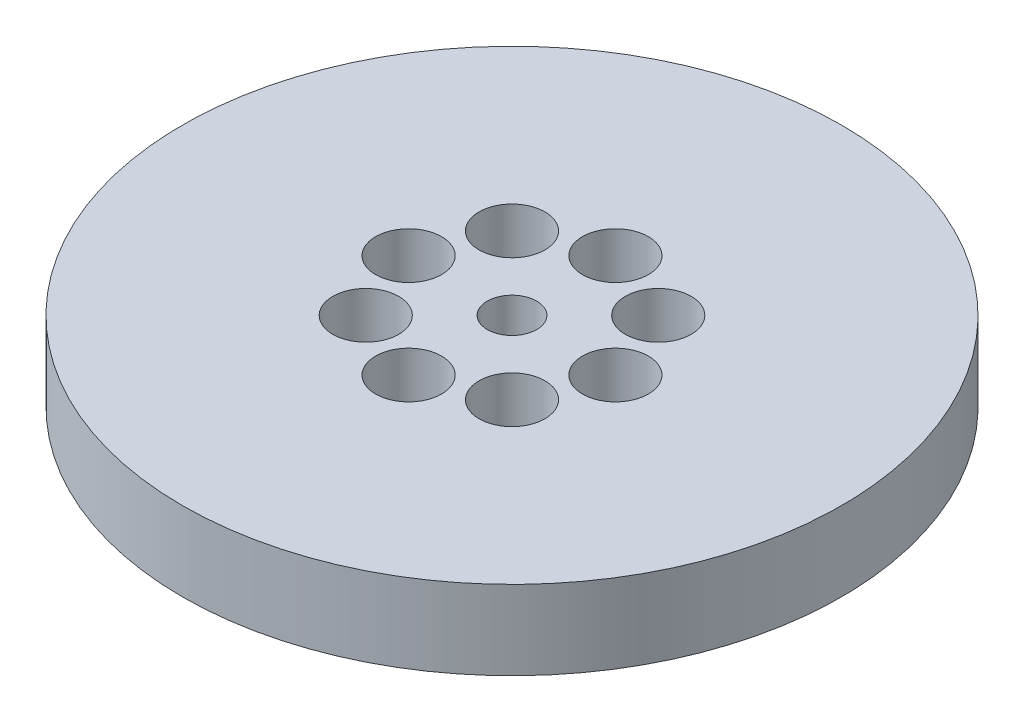
ISO-10303-21;
HEADER;
FILE_DESCRIPTION(('STEP AP214'),'2;1');
FILE_NAME('part.step','',(''),(''),'','','');
FILE_SCHEMA(('AUTOMOTIVE_DESIGN { 1 0 10303 214 1 1 1 1 }'));
ENDSEC;
DATA;
#1=APPLICATION_CONTEXT('core data for automotive mechanical design processes');
#2=APPLICATION_PROTOCOL_DEFINITION('international standard','automotive_design',2000,#1);
#3=PRODUCT_CONTEXT('',#1,'mechanical');
#4=PRODUCT('Part','Part','',(#3));
#5=PRODUCT_RELATED_PRODUCT_CATEGORY('part','',(#4));
#6=PRODUCT_DEFINITION_FORMATION('','',#4);
#7=PRODUCT_DEFINITION_CONTEXT('part definition',#1,'design');
#8=PRODUCT_DEFINITION('design','',#6,#7);
#9=PRODUCT_DEFINITION_SHAPE('','',#8);
#10=(LENGTH_UNIT() NAMED_UNIT(*) SI_UNIT(.MILLI.,.METRE.));
#11=(NAMED_UNIT(*) PLANE_ANGLE_UNIT() SI_UNIT($,.RADIAN.));
#12=(NAMED_UNIT(*) SI_UNIT($,.STERADIAN.) SOLID_ANGLE_UNIT());
#13=UNCERTAINTY_MEASURE_WITH_UNIT(LENGTH_MEASURE(1.E-05),#10,'distance_accuracy_value','');
#14=(GEOMETRIC_REPRESENTATION_CONTEXT(3) GLOBAL_UNCERTAINTY_ASSIGNED_CONTEXT((#13)) GLOBAL_UNIT_ASSIGNED_CONTEXT((#10,
#11,#12)) REPRESENTATION_CONTEXT('',''));
#15=CARTESIAN_POINT('',(0.,0.,0.));
#16=DIRECTION('',(0.,0.,1.));
#17=DIRECTION('',(1.,0.,0.));
#18=AXIS2_PLACEMENT_3D('',#15,#16,#17);
#19=CARTESIAN_POINT('',(0.,24.,0.));
#20=DIRECTION('',(0.,-1.,0.));
#21=DIRECTION('',(0.,0.,-1.));
#22=AXIS2_PLACEMENT_3D('',#19,#20,#21);
#23=CYLINDRICAL_SURFACE('',#22,100.);
#24=CARTESIAN_POINT('',(0.,24.,0.));
#25=DIRECTION('',(0.,1.,0.));
#26=DIRECTION('',(0.,0.,1.));
#27=AXIS2_PLACEMENT_3D('',#24,#25,#26);
#28=CIRCLE('',#27,100.);
#29=CARTESIAN_POINT('',(0.,24.,100.));
#30=VERTEX_POINT('',#29);
#31=EDGE_CURVE('E10',#30,#30,#28,.T.);
#32=ORIENTED_EDGE('',*,*,#31,.F.);
#33=EDGE_LOOP('',(#32));
#34=FACE_BOUND('',#33,.T.);
#35=CARTESIAN_POINT('',(0.,0.,0.));
#36=DIRECTION('',(0.,1.,0.));
#37=DIRECTION('',(0.,0.,1.));
#38=AXIS2_PLACEMENT_3D('',#35,#36,#37);
#39=CIRCLE('',#38,100.);
#40=CARTESIAN_POINT('',(0.,0.,100.));
#41=VERTEX_POINT('',#40);
#42=EDGE_CURVE('E37',#41,#41,#39,.T.);
#43=ORIENTED_EDGE('',*,*,#42,.T.);
#44=EDGE_LOOP('',(#43));
#45=FACE_BOUND('',#44,.T.);
#46=ADVANCED_FACE('F40',(#34,#45),#23,.T.);
#47=CARTESIAN_POINT('',(0.,24.,0.));
#48=DIRECTION('',(0.,1.,0.));
#49=DIRECTION('',(0.,0.,1.));
#50=AXIS2_PLACEMENT_3D('',#47,#48,#49);
#51=PLANE('',#50);
#52=CARTESIAN_POINT('',(1.09555565675562E-13,24.,31.3779611125926));
#53=DIRECTION('',(0.,1.,0.));
#54=DIRECTION('',(1.,0.,0.));
#55=AXIS2_PLACEMENT_3D('',#52,#53,#54);
#56=CIRCLE('',#55,10.);
#57=CARTESIAN_POINT('',(10.0000000000001,24.,31.3779611125925));
#58=VERTEX_POINT('',#57);
#59=EDGE_CURVE('E88',#58,#58,#56,.T.);
#60=ORIENTED_EDGE('',*,*,#59,.F.);
#61=EDGE_LOOP('',(#60));
#62=FACE_BOUND('',#61,.T.);
#63=CARTESIAN_POINT('',(22.1875690825221,24.,22.1875690825219));
#64=DIRECTION('',(0.,1.,0.));
#65=DIRECTION('',(0.707106781186544,0.,-0.707106781186551));
#66=AXIS2_PLACEMENT_3D('',#63,#64,#65);
#67=CIRCLE('',#66,10.);
#68=CARTESIAN_POINT('',(29.2586368943875,24.,15.1165012706564));
#69=VERTEX_POINT('',#68);
#70=EDGE_CURVE('E79',#69,#69,#67,.T.);
#71=ORIENTED_EDGE('',*,*,#70,.F.);
#72=EDGE_LOOP('',(#71));
#73=FACE_BOUND('',#72,.T.);
#74=CARTESIAN_POINT('',(31.3779611125926,24.,0.));
#75=DIRECTION('',(0.,1.,0.));
#76=DIRECTION('',(0.,0.,-1.));
#77=AXIS2_PLACEMENT_3D('',#74,#75,#76);
#78=CIRCLE('',#77,10.);
#79=CARTESIAN_POINT('',(31.3779611125926,24.,-10.));
#80=VERTEX_POINT('',#79);
#81=EDGE_CURVE('E74',#80,#80,#78,.T.);
#82=ORIENTED_EDGE('',*,*,#81,.F.);
#83=EDGE_LOOP('',(#82));
#84=FACE_BOUND('',#83,.T.);
#85=CARTESIAN_POINT('',(22.1875690825218,24.,-22.1875690825222));
#86=DIRECTION('',(0.,1.,0.));
#87=DIRECTION('',(-0.707106781186554,0.,-0.707106781186541));
#88=AXIS2_PLACEMENT_3D('',#85,#86,#87);
#89=CIRCLE('',#88,10.);
#90=CARTESIAN_POINT('',(15.1165012706563,24.,-29.2586368943876));
#91=VERTEX_POINT('',#90);
#92=EDGE_CURVE('E70',#91,#91,#89,.T.);
#93=ORIENTED_EDGE('',*,*,#92,.F.);
#94=EDGE_LOOP('',(#93));
#95=FACE_BOUND('',#94,.T.);
#96=CARTESIAN_POINT('',(-3.28666697026687E-13,24.,-31.3779611125926));
#97=DIRECTION('',(0.,1.,0.));
#98=DIRECTION('',(-1.,0.,0.));
#99=AXIS2_PLACEMENT_3D('',#96,#97,#98);
#100=CIRCLE('',#99,10.);
#101=CARTESIAN_POINT('',(-10.0000000000003,24.,-31.3779611125925));
#102=VERTEX_POINT('',#101);
#103=EDGE_CURVE('E100',#102,#102,#100,.T.);
#104=ORIENTED_EDGE('',*,*,#103,.F.);
#105=EDGE_LOOP('',(#104));
#106=FACE_BOUND('',#105,.T.);
#107=CARTESIAN_POINT('',(-22.1875690825222,24.,-22.1875690825217));
#108=DIRECTION('',(0.,1.,0.));
#109=DIRECTION('',(-0.707106781186539,0.,0.707106781186556));
#110=AXIS2_PLACEMENT_3D('',#107,#108,#109);
#111=CIRCLE('',#110,10.);
#112=CARTESIAN_POINT('',(-29.2586368943876,24.,-15.1165012706562));
#113=VERTEX_POINT('',#112);
#114=EDGE_CURVE('E93',#113,#113,#111,.T.);
#115=ORIENTED_EDGE('',*,*,#114,.F.);
#116=EDGE_LOOP('',(#115));
#117=FACE_BOUND('',#116,.T.);
#118=CARTESIAN_POINT('',(-22.1875690825219,24.,22.187569082522));
#119=DIRECTION('',(0.,1.,0.));
#120=DIRECTION('',(0.707106781186549,0.,0.707106781186546));
#121=AXIS2_PLACEMENT_3D('',#118,#119,#120);
#122=CIRCLE('',#121,10.);
#123=CARTESIAN_POINT('',(-15.1165012706565,24.,29.2586368943875));
#124=VERTEX_POINT('',#123);
#125=EDGE_CURVE('E61',#124,#124,#122,.T.);
#126=ORIENTED_EDGE('',*,*,#125,.F.);
#127=EDGE_LOOP('',(#126));
#128=FACE_BOUND('',#127,.T.);
#129=CARTESIAN_POINT('',(-31.3779611125926,24.,0.));
#130=DIRECTION('',(0.,1.,0.));
#131=DIRECTION('',(0.,0.,1.));
#132=AXIS2_PLACEMENT_3D('',#129,#130,#131);
#133=CIRCLE('',#132,10.);
#134=CARTESIAN_POINT('',(-31.3779611125926,24.,10.));
#135=VERTEX_POINT('',#134);
#136=EDGE_CURVE('E54',#135,#135,#133,.T.);
#137=ORIENTED_EDGE('',*,*,#136,.F.);
#138=EDGE_LOOP('',(#137));
#139=FACE_BOUND('',#138,.T.);
#140=CARTESIAN_POINT('',(0.,24.,0.));
#141=DIRECTION('',(0.,1.,0.));
#142=DIRECTION('',(0.,0.,1.));
#143=AXIS2_PLACEMENT_3D('',#140,#141,#142);
#144=CIRCLE('',#143,7.5);
#145=CARTESIAN_POINT('',(0.,24.,7.5));
#146=VERTEX_POINT('',#145);
#147=EDGE_CURVE('E50',#146,#146,#144,.T.);
#148=ORIENTED_EDGE('',*,*,#147,.F.);
#149=EDGE_LOOP('',(#148));
#150=FACE_BOUND('',#149,.T.);
#151=ORIENTED_EDGE('',*,*,#31,.T.);
#152=EDGE_LOOP('',(#151));
#153=FACE_BOUND('',#152,.T.);
#154=ADVANCED_FACE('F115',(#62,#73,#84,#95,#106,#117,#128,#139,#150,#153),#51,.T.);
#155=CARTESIAN_POINT('',(0.,0.,0.));
#156=DIRECTION('',(0.,1.,0.));
#157=DIRECTION('',(0.,0.,1.));
#158=AXIS2_PLACEMENT_3D('',#155,#156,#157);
#159=PLANE('',#158);
#160=CARTESIAN_POINT('',(0.,0.,0.));
#161=DIRECTION('',(0.,1.,0.));
#162=DIRECTION('',(0.,0.,1.));
#163=AXIS2_PLACEMENT_3D('',#160,#161,#162);
#164=CIRCLE('',#163,7.5);
#165=CARTESIAN_POINT('',(0.,0.,7.5));
#166=VERTEX_POINT('',#165);
#167=EDGE_CURVE('E47',#166,#166,#164,.T.);
#168=ORIENTED_EDGE('',*,*,#167,.T.);
#169=EDGE_LOOP('',(#168));
#170=FACE_BOUND('',#169,.T.);
#171=ORIENTED_EDGE('',*,*,#42,.F.);
#172=EDGE_LOOP('',(#171));
#173=FACE_BOUND('',#172,.T.);
#174=ADVANCED_FACE('F113',(#170,#173),#159,.F.);
#175=CARTESIAN_POINT('',(0.,24.,0.));
#176=DIRECTION('',(0.,-1.,0.));
#177=DIRECTION('',(0.,0.,-1.));
#178=AXIS2_PLACEMENT_3D('',#175,#176,#177);
#179=CYLINDRICAL_SURFACE('',#178,7.5);
#180=ORIENTED_EDGE('',*,*,#147,.T.);
#181=EDGE_LOOP('',(#180));
#182=FACE_BOUND('',#181,.T.);
#183=ORIENTED_EDGE('',*,*,#167,.F.);
#184=EDGE_LOOP('',(#183));
#185=FACE_BOUND('',#184,.T.);
#186=ADVANCED_FACE('F127',(#182,#185),#179,.F.);
#187=CARTESIAN_POINT('',(-31.3779611125926,3.09669997128235,0.));
#188=DIRECTION('',(0.,1.,0.));
#189=DIRECTION('',(0.,0.,1.));
#190=AXIS2_PLACEMENT_3D('',#187,#188,#189);
#191=CYLINDRICAL_SURFACE('',#190,10.);
#192=CARTESIAN_POINT('',(-31.3779611125926,3.09669997128235,0.));
#193=DIRECTION('',(0.,1.,0.));
#194=DIRECTION('',(0.,0.,1.));
#195=AXIS2_PLACEMENT_3D('',#192,#193,#194);
#196=CIRCLE('',#195,10.);
#197=CARTESIAN_POINT('',(-31.3779611125926,3.09669997128235,10.));
#198=VERTEX_POINT('',#197);
#199=EDGE_CURVE('E55',#198,#198,#196,.T.);
#200=ORIENTED_EDGE('',*,*,#199,.F.);
#201=EDGE_LOOP('',(#200));
#202=FACE_BOUND('',#201,.T.);
#203=ORIENTED_EDGE('',*,*,#136,.T.);
#204=EDGE_LOOP('',(#203));
#205=FACE_BOUND('',#204,.T.);
#206=ADVANCED_FACE('F129',(#202,#205),#191,.F.);
#207=CARTESIAN_POINT('',(-31.3779611125926,3.09669997128235,0.));
#208=DIRECTION('',(0.,1.,0.));
#209=DIRECTION('',(0.,0.,1.));
#210=AXIS2_PLACEMENT_3D('',#207,#208,#209);
#211=PLANE('',#210);
#212=ORIENTED_EDGE('',*,*,#199,.T.);
#213=EDGE_LOOP('',(#212));
#214=FACE_BOUND('',#213,.T.);
#215=ADVANCED_FACE('F157',(#214),#211,.T.);
#216=CARTESIAN_POINT('',(-22.1875690825219,3.09669997128235,22.187569082522));
#217=DIRECTION('',(0.,1.,0.));
#218=DIRECTION('',(0.,0.,1.));
#219=AXIS2_PLACEMENT_3D('',#216,#217,#218);
#220=CYLINDRICAL_SURFACE('',#219,10.);
#221=CARTESIAN_POINT('',(-22.1875690825219,3.09669997128235,22.187569082522));
#222=DIRECTION('',(0.,1.,0.));
#223=DIRECTION('',(0.707106781186549,0.,0.707106781186546));
#224=AXIS2_PLACEMENT_3D('',#221,#222,#223);
#225=CIRCLE('',#224,10.);
#226=CARTESIAN_POINT('',(-15.1165012706565,3.09669997128235,29.2586368943875));
#227=VERTEX_POINT('',#226);
#228=EDGE_CURVE('E59',#227,#227,#225,.T.);
#229=ORIENTED_EDGE('',*,*,#228,.F.);
#230=EDGE_LOOP('',(#229));
#231=FACE_BOUND('',#230,.T.);
#232=ORIENTED_EDGE('',*,*,#125,.T.);
#233=EDGE_LOOP('',(#232));
#234=FACE_BOUND('',#233,.T.);
#235=ADVANCED_FACE('F170',(#231,#234),#220,.F.);
#236=CARTESIAN_POINT('',(-22.1875690825219,3.09669997128235,22.187569082522));
#237=DIRECTION('',(0.,1.,0.));
#238=DIRECTION('',(0.707106781186549,0.,0.707106781186546));
#239=AXIS2_PLACEMENT_3D('',#236,#237,#238);
#240=PLANE('',#239);
#241=ORIENTED_EDGE('',*,*,#228,.T.);
#242=EDGE_LOOP('',(#241));
#243=FACE_BOUND('',#242,.T.);
#244=ADVANCED_FACE('F182',(#243),#240,.T.);
#245=CARTESIAN_POINT('',(-22.1875690825222,3.09669997128235,-22.1875690825217));
#246=DIRECTION('',(0.,1.,0.));
#247=DIRECTION('',(0.,0.,1.));
#248=AXIS2_PLACEMENT_3D('',#245,#246,#247);
#249=CYLINDRICAL_SURFACE('',#248,10.);
#250=CARTESIAN_POINT('',(-22.1875690825222,3.09669997128235,-22.1875690825217));
#251=DIRECTION('',(0.,1.,0.));
#252=DIRECTION('',(-0.707106781186539,0.,0.707106781186556));
#253=AXIS2_PLACEMENT_3D('',#250,#251,#252);
#254=CIRCLE('',#253,10.);
#255=CARTESIAN_POINT('',(-29.2586368943876,3.09669997128235,-15.1165012706562));
#256=VERTEX_POINT('',#255);
#257=EDGE_CURVE('E94',#256,#256,#254,.T.);
#258=ORIENTED_EDGE('',*,*,#257,.F.);
#259=EDGE_LOOP('',(#258));
#260=FACE_BOUND('',#259,.T.);
#261=ORIENTED_EDGE('',*,*,#114,.T.);
#262=EDGE_LOOP('',(#261));
#263=FACE_BOUND('',#262,.T.);
#264=ADVANCED_FACE('F189',(#260,#263),#249,.F.);
#265=CARTESIAN_POINT('',(-22.1875690825222,3.09669997128235,-22.1875690825217));
#266=DIRECTION('',(0.,1.,0.));
#267=DIRECTION('',(-0.707106781186539,0.,0.707106781186556));
#268=AXIS2_PLACEMENT_3D('',#265,#266,#267);
#269=PLANE('',#268);
#270=ORIENTED_EDGE('',*,*,#257,.T.);
#271=EDGE_LOOP('',(#270));
#272=FACE_BOUND('',#271,.T.);
#273=ADVANCED_FACE('F107',(#272),#269,.T.);
#274=CARTESIAN_POINT('',(-3.28666697026687E-13,3.09669997128235,-31.3779611125926));
#275=DIRECTION('',(0.,1.,0.));
#276=DIRECTION('',(0.,0.,1.));
#277=AXIS2_PLACEMENT_3D('',#274,#275,#276);
#278=CYLINDRICAL_SURFACE('',#277,10.);
#279=CARTESIAN_POINT('',(-3.28666697026687E-13,3.09669997128235,-31.3779611125926));
#280=DIRECTION('',(0.,1.,0.));
#281=DIRECTION('',(-1.,0.,0.));
#282=AXIS2_PLACEMENT_3D('',#279,#280,#281);
#283=CIRCLE('',#282,10.);
#284=CARTESIAN_POINT('',(-10.0000000000003,3.09669997128235,-31.3779611125925));
#285=VERTEX_POINT('',#284);
#286=EDGE_CURVE('E72',#285,#285,#283,.T.);
#287=ORIENTED_EDGE('',*,*,#286,.F.);
#288=EDGE_LOOP('',(#287));
#289=FACE_BOUND('',#288,.T.);
#290=ORIENTED_EDGE('',*,*,#103,.T.);
#291=EDGE_LOOP('',(#290));
#292=FACE_BOUND('',#291,.T.);
#293=ADVANCED_FACE('F104',(#289,#292),#278,.F.);
#294=CARTESIAN_POINT('',(-3.28666697026687E-13,3.09669997128235,-31.3779611125926));
#295=DIRECTION('',(0.,1.,0.));
#296=DIRECTION('',(-1.,0.,0.));
#297=AXIS2_PLACEMENT_3D('',#294,#295,#296);
#298=PLANE('',#297);
#299=ORIENTED_EDGE('',*,*,#286,.T.);
#300=EDGE_LOOP('',(#299));
#301=FACE_BOUND('',#300,.T.);
#302=ADVANCED_FACE('F103',(#301),#298,.T.);
#303=CARTESIAN_POINT('',(22.1875690825218,3.09669997128235,-22.1875690825222));
#304=DIRECTION('',(0.,1.,0.));
#305=DIRECTION('',(0.,0.,1.));
#306=AXIS2_PLACEMENT_3D('',#303,#304,#305);
#307=CYLINDRICAL_SURFACE('',#306,10.);
#308=CARTESIAN_POINT('',(22.1875690825218,3.09669997128235,-22.1875690825222));
#309=DIRECTION('',(0.,1.,0.));
#310=DIRECTION('',(-0.707106781186554,0.,-0.707106781186541));
#311=AXIS2_PLACEMENT_3D('',#308,#309,#310);
#312=CIRCLE('',#311,10.);
#313=CARTESIAN_POINT('',(15.1165012706563,3.09669997128235,-29.2586368943876));
#314=VERTEX_POINT('',#313);
#315=EDGE_CURVE('E69',#314,#314,#312,.T.);
#316=ORIENTED_EDGE('',*,*,#315,.F.);
#317=EDGE_LOOP('',(#316));
#318=FACE_BOUND('',#317,.T.);
#319=ORIENTED_EDGE('',*,*,#92,.T.);
#320=EDGE_LOOP('',(#319));
#321=FACE_BOUND('',#320,.T.);
#322=ADVANCED_FACE('F219',(#318,#321),#307,.F.);
#323=CARTESIAN_POINT('',(22.1875690825218,3.09669997128235,-22.1875690825222));
#324=DIRECTION('',(0.,1.,0.));
#325=DIRECTION('',(-0.707106781186554,0.,-0.707106781186541));
#326=AXIS2_PLACEMENT_3D('',#323,#324,#325);
#327=PLANE('',#326);
#328=ORIENTED_EDGE('',*,*,#315,.T.);
#329=EDGE_LOOP('',(#328));
#330=FACE_BOUND('',#329,.T.);
#331=ADVANCED_FACE('F227',(#330),#327,.T.);
#332=CARTESIAN_POINT('',(31.3779611125926,3.09669997128235,0.));
#333=DIRECTION('',(0.,1.,0.));
#334=DIRECTION('',(0.,0.,1.));
#335=AXIS2_PLACEMENT_3D('',#332,#333,#334);
#336=CYLINDRICAL_SURFACE('',#335,10.);
#337=CARTESIAN_POINT('',(31.3779611125926,3.09669997128235,0.));
#338=DIRECTION('',(0.,1.,0.));
#339=DIRECTION('',(0.,0.,-1.));
#340=AXIS2_PLACEMENT_3D('',#337,#338,#339);
#341=CIRCLE('',#340,10.);
#342=CARTESIAN_POINT('',(31.3779611125926,3.09669997128235,-10.));
#343=VERTEX_POINT('',#342);
#344=EDGE_CURVE('E80',#343,#343,#341,.T.);
#345=ORIENTED_EDGE('',*,*,#344,.F.);
#346=EDGE_LOOP('',(#345));
#347=FACE_BOUND('',#346,.T.);
#348=ORIENTED_EDGE('',*,*,#81,.T.);
#349=EDGE_LOOP('',(#348));
#350=FACE_BOUND('',#349,.T.);
#351=ADVANCED_FACE('F240',(#347,#350),#336,.F.);
#352=CARTESIAN_POINT('',(31.3779611125926,3.09669997128235,0.));
#353=DIRECTION('',(0.,1.,0.));
#354=DIRECTION('',(0.,0.,-1.));
#355=AXIS2_PLACEMENT_3D('',#352,#353,#354);
#356=PLANE('',#355);
#357=ORIENTED_EDGE('',*,*,#344,.T.);
#358=EDGE_LOOP('',(#357));
#359=FACE_BOUND('',#358,.T.);
#360=ADVANCED_FACE('F246',(#359),#356,.T.);
#361=CARTESIAN_POINT('',(22.1875690825221,3.09669997128235,22.1875690825219));
#362=DIRECTION('',(0.,1.,0.));
#363=DIRECTION('',(0.,0.,1.));
#364=AXIS2_PLACEMENT_3D('',#361,#362,#363);
#365=CYLINDRICAL_SURFACE('',#364,10.);
#366=CARTESIAN_POINT('',(22.1875690825221,3.09669997128235,22.1875690825219));
#367=DIRECTION('',(0.,1.,0.));
#368=DIRECTION('',(0.707106781186544,0.,-0.707106781186551));
#369=AXIS2_PLACEMENT_3D('',#366,#367,#368);
#370=CIRCLE('',#369,10.);
#371=CARTESIAN_POINT('',(29.2586368943875,3.09669997128235,15.1165012706564));
#372=VERTEX_POINT('',#371);
#373=EDGE_CURVE('E82',#372,#372,#370,.T.);
#374=ORIENTED_EDGE('',*,*,#373,.F.);
#375=EDGE_LOOP('',(#374));
#376=FACE_BOUND('',#375,.T.);
#377=ORIENTED_EDGE('',*,*,#70,.T.);
#378=EDGE_LOOP('',(#377));
#379=FACE_BOUND('',#378,.T.);
#380=ADVANCED_FACE('F254',(#376,#379),#365,.F.);
#381=CARTESIAN_POINT('',(22.1875690825221,3.09669997128235,22.1875690825219));
#382=DIRECTION('',(0.,1.,0.));
#383=DIRECTION('',(0.707106781186544,0.,-0.707106781186551));
#384=AXIS2_PLACEMENT_3D('',#381,#382,#383);
#385=PLANE('',#384);
#386=ORIENTED_EDGE('',*,*,#373,.T.);
#387=EDGE_LOOP('',(#386));
#388=FACE_BOUND('',#387,.T.);
#389=ADVANCED_FACE('F262',(#388),#385,.T.);
#390=CARTESIAN_POINT('',(1.09555565675562E-13,3.09669997128235,31.3779611125926));
#391=DIRECTION('',(0.,1.,0.));
#392=DIRECTION('',(0.,0.,1.));
#393=AXIS2_PLACEMENT_3D('',#390,#391,#392);
#394=CYLINDRICAL_SURFACE('',#393,10.);
#395=CARTESIAN_POINT('',(1.09555565675562E-13,3.09669997128235,31.3779611125926));
#396=DIRECTION('',(0.,1.,0.));
#397=DIRECTION('',(1.,0.,0.));
#398=AXIS2_PLACEMENT_3D('',#395,#396,#397);
#399=CIRCLE('',#398,10.);
#400=CARTESIAN_POINT('',(10.0000000000001,3.09669997128235,31.3779611125925));
#401=VERTEX_POINT('',#400);
#402=EDGE_CURVE('E63',#401,#401,#399,.T.);
#403=ORIENTED_EDGE('',*,*,#402,.F.);
#404=EDGE_LOOP('',(#403));
#405=FACE_BOUND('',#404,.T.);
#406=ORIENTED_EDGE('',*,*,#59,.T.);
#407=EDGE_LOOP('',(#406));
#408=FACE_BOUND('',#407,.T.);
#409=ADVANCED_FACE('F272',(#405,#408),#394,.F.);
#410=CARTESIAN_POINT('',(1.09555565675562E-13,3.09669997128235,31.3779611125926));
#411=DIRECTION('',(0.,1.,0.));
#412=DIRECTION('',(1.,0.,0.));
#413=AXIS2_PLACEMENT_3D('',#410,#411,#412);
#414=PLANE('',#413);
#415=ORIENTED_EDGE('',*,*,#402,.T.);
#416=EDGE_LOOP('',(#415));
#417=FACE_BOUND('',#416,.T.);
#418=ADVANCED_FACE('F285',(#417),#414,.T.);
#419=CLOSED_SHELL('',(#46,#154,#174,#186,#206,#215,#235,#244,#264,#273,#293,#302,#322,#331,#351,
#360,#380,#389,#409,#418));
#420=MANIFOLD_SOLID_BREP('B2',#419);
#421=ADVANCED_BREP_SHAPE_REPRESENTATION('',(#18,#420),#14);
#422=SHAPE_DEFINITION_REPRESENTATION(#9,#421);
ENDSEC;
END-ISO-10303-21;
